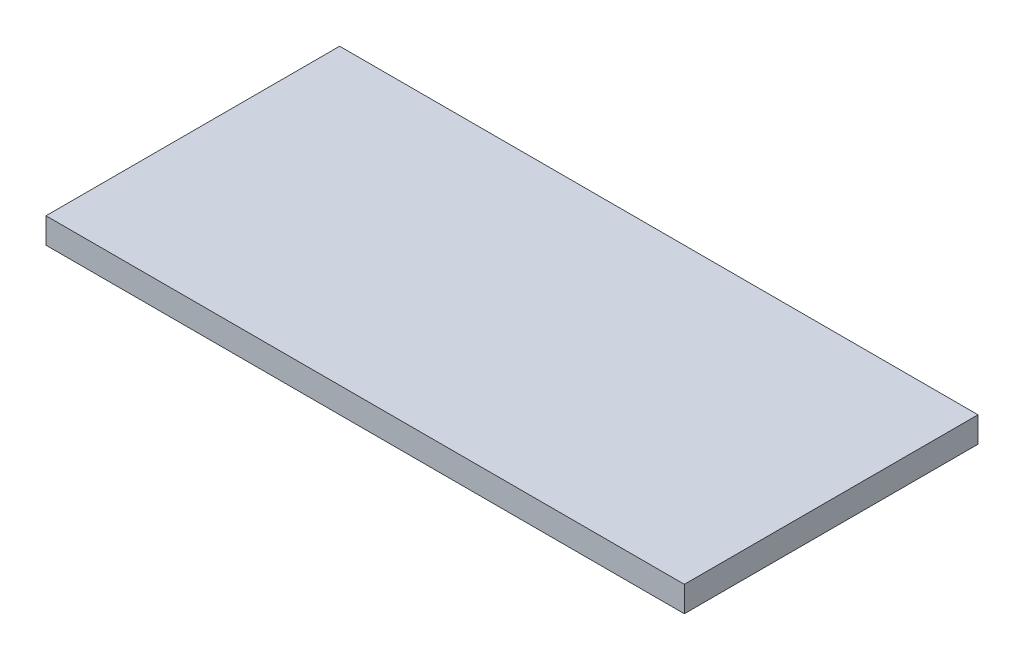
ISO-10303-21;
HEADER;
FILE_DESCRIPTION(('STEP AP214'),'2;1');
FILE_NAME('part.step','',(''),(''),'','','');
FILE_SCHEMA(('AUTOMOTIVE_DESIGN { 1 0 10303 214 1 1 1 1 }'));
ENDSEC;
DATA;
#1=APPLICATION_CONTEXT('core data for automotive mechanical design processes');
#2=APPLICATION_PROTOCOL_DEFINITION('international standard','automotive_design',2000,#1);
#3=PRODUCT_CONTEXT('',#1,'mechanical');
#4=PRODUCT('Part','Part','',(#3));
#5=PRODUCT_RELATED_PRODUCT_CATEGORY('part','',(#4));
#6=PRODUCT_DEFINITION_FORMATION('','',#4);
#7=PRODUCT_DEFINITION_CONTEXT('part definition',#1,'design');
#8=PRODUCT_DEFINITION('design','',#6,#7);
#9=PRODUCT_DEFINITION_SHAPE('','',#8);
#10=(LENGTH_UNIT() NAMED_UNIT(*) SI_UNIT(.MILLI.,.METRE.));
#11=(NAMED_UNIT(*) PLANE_ANGLE_UNIT() SI_UNIT($,.RADIAN.));
#12=(NAMED_UNIT(*) SI_UNIT($,.STERADIAN.) SOLID_ANGLE_UNIT());
#13=UNCERTAINTY_MEASURE_WITH_UNIT(LENGTH_MEASURE(1.E-05),#10,'distance_accuracy_value','');
#14=(GEOMETRIC_REPRESENTATION_CONTEXT(3) GLOBAL_UNCERTAINTY_ASSIGNED_CONTEXT((#13)) GLOBAL_UNIT_ASSIGNED_CONTEXT((#10,
#11,#12)) REPRESENTATION_CONTEXT('',''));
#15=CARTESIAN_POINT('',(0.,0.,0.));
#16=DIRECTION('',(0.,0.,1.));
#17=DIRECTION('',(1.,0.,0.));
#18=AXIS2_PLACEMENT_3D('',#15,#16,#17);
#19=CARTESIAN_POINT('',(75.,6.,34.5));
#20=DIRECTION('',(-1.,0.,0.));
#21=DIRECTION('',(0.,0.,1.));
#22=AXIS2_PLACEMENT_3D('',#19,#20,#21);
#23=PLANE('',#22);
#24=DIRECTION('',(0.,0.,-1.));
#25=VECTOR('',#24,1.);
#26=CARTESIAN_POINT('',(75.,0.,34.5));
#27=LINE('',#26,#25);
#28=CARTESIAN_POINT('',(75.,0.,34.5));
#29=VERTEX_POINT('',#28);
#30=CARTESIAN_POINT('',(75.,0.,-34.5));
#31=VERTEX_POINT('',#30);
#32=EDGE_CURVE('E98',#29,#31,#27,.T.);
#33=ORIENTED_EDGE('',*,*,#32,.T.);
#34=DIRECTION('',(0.,-1.,0.));
#35=VECTOR('',#34,1.);
#36=CARTESIAN_POINT('',(75.,6.,-34.5));
#37=LINE('',#36,#35);
#38=CARTESIAN_POINT('',(75.,6.,-34.5));
#39=VERTEX_POINT('',#38);
#40=EDGE_CURVE('E11',#39,#31,#37,.T.);
#41=ORIENTED_EDGE('',*,*,#40,.F.);
#42=DIRECTION('',(0.,0.,-1.));
#43=VECTOR('',#42,1.);
#44=CARTESIAN_POINT('',(75.,6.,34.5));
#45=LINE('',#44,#43);
#46=CARTESIAN_POINT('',(75.,6.,34.5));
#47=VERTEX_POINT('',#46);
#48=EDGE_CURVE('E86',#47,#39,#45,.T.);
#49=ORIENTED_EDGE('',*,*,#48,.F.);
#50=DIRECTION('',(0.,-1.,0.));
#51=VECTOR('',#50,1.);
#52=CARTESIAN_POINT('',(75.,6.,34.5));
#53=LINE('',#52,#51);
#54=EDGE_CURVE('E94',#47,#29,#53,.T.);
#55=ORIENTED_EDGE('',*,*,#54,.T.);
#56=EDGE_LOOP('',(#33,#41,#49,#55));
#57=FACE_BOUND('',#56,.T.);
#58=ADVANCED_FACE('F35',(#57),#23,.F.);
#59=CARTESIAN_POINT('',(-75.,6.,-34.5));
#60=DIRECTION('',(0.,0.,1.));
#61=DIRECTION('',(1.,0.,0.));
#62=AXIS2_PLACEMENT_3D('',#59,#60,#61);
#63=PLANE('',#62);
#64=DIRECTION('',(-1.,0.,0.));
#65=VECTOR('',#64,1.);
#66=CARTESIAN_POINT('',(-75.,0.,-34.5));
#67=LINE('',#66,#65);
#68=CARTESIAN_POINT('',(-75.,0.,-34.5));
#69=VERTEX_POINT('',#68);
#70=EDGE_CURVE('E90',#31,#69,#67,.T.);
#71=ORIENTED_EDGE('',*,*,#70,.T.);
#72=DIRECTION('',(0.,-1.,0.));
#73=VECTOR('',#72,1.);
#74=CARTESIAN_POINT('',(-75.,6.,-34.5));
#75=LINE('',#74,#73);
#76=CARTESIAN_POINT('',(-75.,6.,-34.5));
#77=VERTEX_POINT('',#76);
#78=EDGE_CURVE('E43',#77,#69,#75,.T.);
#79=ORIENTED_EDGE('',*,*,#78,.F.);
#80=DIRECTION('',(-1.,0.,0.));
#81=VECTOR('',#80,1.);
#82=CARTESIAN_POINT('',(-75.,6.,-34.5));
#83=LINE('',#82,#81);
#84=EDGE_CURVE('E81',#39,#77,#83,.T.);
#85=ORIENTED_EDGE('',*,*,#84,.F.);
#86=ORIENTED_EDGE('',*,*,#40,.T.);
#87=EDGE_LOOP('',(#71,#79,#85,#86));
#88=FACE_BOUND('',#87,.T.);
#89=ADVANCED_FACE('F89',(#88),#63,.F.);
#90=CARTESIAN_POINT('',(-75.,6.,34.5));
#91=DIRECTION('',(1.,0.,0.));
#92=DIRECTION('',(0.,0.,-1.));
#93=AXIS2_PLACEMENT_3D('',#90,#91,#92);
#94=PLANE('',#93);
#95=DIRECTION('',(0.,0.,1.));
#96=VECTOR('',#95,1.);
#97=CARTESIAN_POINT('',(-75.,0.,34.5));
#98=LINE('',#97,#96);
#99=CARTESIAN_POINT('',(-75.,0.,34.5));
#100=VERTEX_POINT('',#99);
#101=EDGE_CURVE('E68',#69,#100,#98,.T.);
#102=ORIENTED_EDGE('',*,*,#101,.T.);
#103=DIRECTION('',(0.,-1.,0.));
#104=VECTOR('',#103,1.);
#105=CARTESIAN_POINT('',(-75.,6.,34.5));
#106=LINE('',#105,#104);
#107=CARTESIAN_POINT('',(-75.,6.,34.5));
#108=VERTEX_POINT('',#107);
#109=EDGE_CURVE('E91',#108,#100,#106,.T.);
#110=ORIENTED_EDGE('',*,*,#109,.F.);
#111=DIRECTION('',(0.,0.,1.));
#112=VECTOR('',#111,1.);
#113=CARTESIAN_POINT('',(-75.,6.,34.5));
#114=LINE('',#113,#112);
#115=EDGE_CURVE('E84',#77,#108,#114,.T.);
#116=ORIENTED_EDGE('',*,*,#115,.F.);
#117=ORIENTED_EDGE('',*,*,#78,.T.);
#118=EDGE_LOOP('',(#102,#110,#116,#117));
#119=FACE_BOUND('',#118,.T.);
#120=ADVANCED_FACE('F92',(#119),#94,.F.);
#121=CARTESIAN_POINT('',(-75.,6.,34.5));
#122=DIRECTION('',(0.,0.,-1.));
#123=DIRECTION('',(-1.,0.,0.));
#124=AXIS2_PLACEMENT_3D('',#121,#122,#123);
#125=PLANE('',#124);
#126=DIRECTION('',(1.,0.,0.));
#127=VECTOR('',#126,1.);
#128=CARTESIAN_POINT('',(-75.,0.,34.5));
#129=LINE('',#128,#127);
#130=EDGE_CURVE('E74',#100,#29,#129,.T.);
#131=ORIENTED_EDGE('',*,*,#130,.T.);
#132=ORIENTED_EDGE('',*,*,#54,.F.);
#133=DIRECTION('',(1.,0.,0.));
#134=VECTOR('',#133,1.);
#135=CARTESIAN_POINT('',(-75.,6.,34.5));
#136=LINE('',#135,#134);
#137=EDGE_CURVE('E51',#108,#47,#136,.T.);
#138=ORIENTED_EDGE('',*,*,#137,.F.);
#139=ORIENTED_EDGE('',*,*,#109,.T.);
#140=EDGE_LOOP('',(#131,#132,#138,#139));
#141=FACE_BOUND('',#140,.T.);
#142=ADVANCED_FACE('F105',(#141),#125,.F.);
#143=CARTESIAN_POINT('',(0.,6.,0.));
#144=DIRECTION('',(0.,-1.,0.));
#145=DIRECTION('',(0.,0.,-1.));
#146=AXIS2_PLACEMENT_3D('',#143,#144,#145);
#147=PLANE('',#146);
#148=ORIENTED_EDGE('',*,*,#48,.T.);
#149=ORIENTED_EDGE('',*,*,#84,.T.);
#150=ORIENTED_EDGE('',*,*,#115,.T.);
#151=ORIENTED_EDGE('',*,*,#137,.T.);
#152=EDGE_LOOP('',(#148,#149,#150,#151));
#153=FACE_BOUND('',#152,.T.);
#154=ADVANCED_FACE('F82',(#153),#147,.F.);
#155=CARTESIAN_POINT('',(0.,0.,0.));
#156=DIRECTION('',(0.,-1.,0.));
#157=DIRECTION('',(0.,0.,-1.));
#158=AXIS2_PLACEMENT_3D('',#155,#156,#157);
#159=PLANE('',#158);
#160=ORIENTED_EDGE('',*,*,#32,.F.);
#161=ORIENTED_EDGE('',*,*,#130,.F.);
#162=ORIENTED_EDGE('',*,*,#101,.F.);
#163=ORIENTED_EDGE('',*,*,#70,.F.);
#164=EDGE_LOOP('',(#160,#161,#162,#163));
#165=FACE_BOUND('',#164,.T.);
#166=ADVANCED_FACE('F108',(#165),#159,.T.);
#167=CLOSED_SHELL('',(#58,#89,#120,#142,#154,#166));
#168=MANIFOLD_SOLID_BREP('B2',#167);
#169=ADVANCED_BREP_SHAPE_REPRESENTATION('',(#18,#168),#14);
#170=SHAPE_DEFINITION_REPRESENTATION(#9,#169);
ENDSEC;
END-ISO-10303-21;
